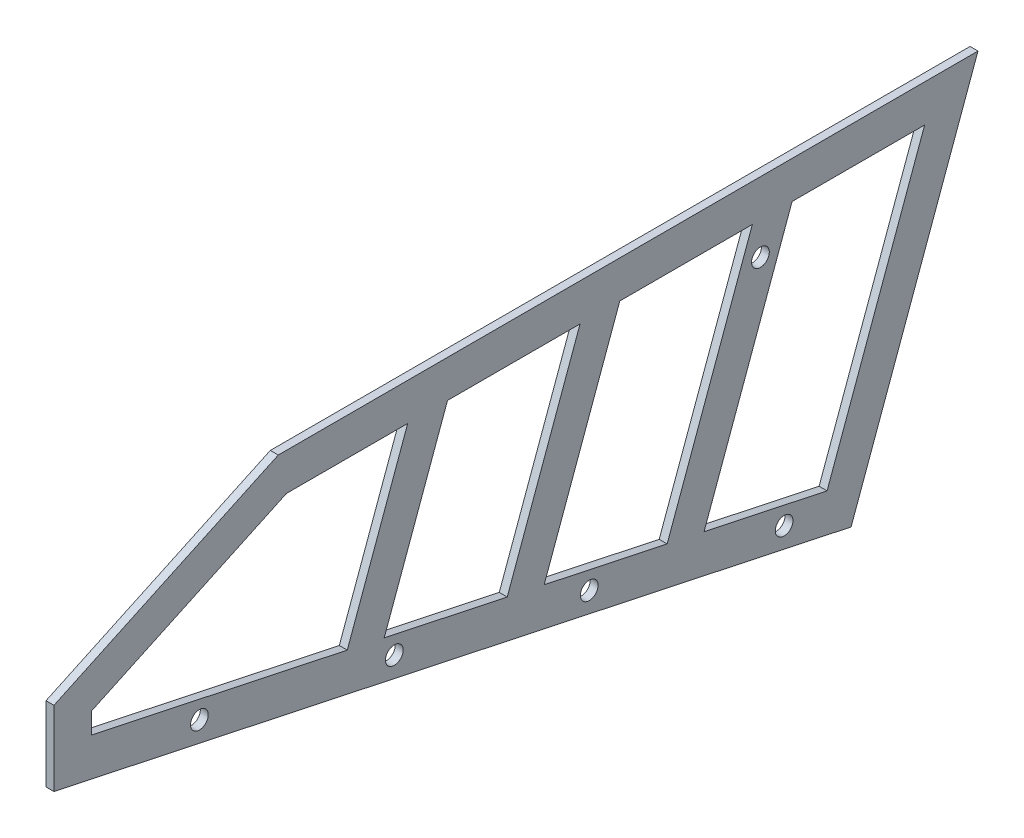
ISO-10303-21;
HEADER;
FILE_DESCRIPTION(('STEP AP214'),'2;1');
FILE_NAME('part.step','',(''),(''),'','','');
FILE_SCHEMA(('AUTOMOTIVE_DESIGN { 1 0 10303 214 1 1 1 1 }'));
ENDSEC;
DATA;
#1=APPLICATION_CONTEXT('core data for automotive mechanical design processes');
#2=APPLICATION_PROTOCOL_DEFINITION('international standard','automotive_design',2000,#1);
#3=PRODUCT_CONTEXT('',#1,'mechanical');
#4=PRODUCT('Part','Part','',(#3));
#5=PRODUCT_RELATED_PRODUCT_CATEGORY('part','',(#4));
#6=PRODUCT_DEFINITION_FORMATION('','',#4);
#7=PRODUCT_DEFINITION_CONTEXT('part definition',#1,'design');
#8=PRODUCT_DEFINITION('design','',#6,#7);
#9=PRODUCT_DEFINITION_SHAPE('','',#8);
#10=(LENGTH_UNIT() NAMED_UNIT(*) SI_UNIT(.MILLI.,.METRE.));
#11=(NAMED_UNIT(*) PLANE_ANGLE_UNIT() SI_UNIT($,.RADIAN.));
#12=(NAMED_UNIT(*) SI_UNIT($,.STERADIAN.) SOLID_ANGLE_UNIT());
#13=UNCERTAINTY_MEASURE_WITH_UNIT(LENGTH_MEASURE(1.E-05),#10,'distance_accuracy_value','');
#14=(GEOMETRIC_REPRESENTATION_CONTEXT(3) GLOBAL_UNCERTAINTY_ASSIGNED_CONTEXT((#13)) GLOBAL_UNIT_ASSIGNED_CONTEXT((#10,
#11,#12)) REPRESENTATION_CONTEXT('',''));
#15=CARTESIAN_POINT('',(0.,0.,0.));
#16=DIRECTION('',(0.,0.,1.));
#17=DIRECTION('',(1.,0.,0.));
#18=AXIS2_PLACEMENT_3D('',#15,#16,#17);
#19=CARTESIAN_POINT('',(1.651,44.45,-16.1784769131329));
#20=DIRECTION('',(0.,1.,0.));
#21=DIRECTION('',(0.,0.,1.));
#22=AXIS2_PLACEMENT_3D('',#19,#20,#21);
#23=PLANE('',#22);
#24=DIRECTION('',(0.,0.,-1.));
#25=VECTOR('',#24,1.);
#26=CARTESIAN_POINT('',(0.635,44.45,-16.1784769131329));
#27=LINE('',#26,#25);
#28=CARTESIAN_POINT('',(0.635,44.45,73.0153239793115));
#29=VERTEX_POINT('',#28);
#30=CARTESIAN_POINT('',(0.635,44.45,-16.1784769131329));
#31=VERTEX_POINT('',#30);
#32=EDGE_CURVE('E340',#29,#31,#27,.T.);
#33=ORIENTED_EDGE('',*,*,#32,.F.);
#34=DIRECTION('',(-1.,0.,0.));
#35=VECTOR('',#34,1.);
#36=CARTESIAN_POINT('',(1.651,44.45,73.0153239793115));
#37=LINE('',#36,#35);
#38=CARTESIAN_POINT('',(1.651,44.45,73.0153239793115));
#39=VERTEX_POINT('',#38);
#40=EDGE_CURVE('E11',#39,#29,#37,.T.);
#41=ORIENTED_EDGE('',*,*,#40,.F.);
#42=DIRECTION('',(0.,0.,-1.));
#43=VECTOR('',#42,1.);
#44=CARTESIAN_POINT('',(1.651,44.45,-16.1784769131329));
#45=LINE('',#44,#43);
#46=CARTESIAN_POINT('',(1.651,44.45,-16.1784769131329));
#47=VERTEX_POINT('',#46);
#48=EDGE_CURVE('E349',#39,#47,#45,.T.);
#49=ORIENTED_EDGE('',*,*,#48,.T.);
#50=DIRECTION('',(-1.,0.,0.));
#51=VECTOR('',#50,1.);
#52=CARTESIAN_POINT('',(1.651,44.45,-16.1784769131329));
#53=LINE('',#52,#51);
#54=EDGE_CURVE('E34',#47,#31,#53,.T.);
#55=ORIENTED_EDGE('',*,*,#54,.T.);
#56=EDGE_LOOP('',(#33,#41,#49,#55));
#57=FACE_BOUND('',#56,.T.);
#58=ADVANCED_FACE('F31',(#57),#23,.T.);
#59=CARTESIAN_POINT('',(1.651,44.45,73.0153239793115));
#60=DIRECTION('',(0.,0.906307787036651,0.422618261740697));
#61=DIRECTION('',(0.,-0.422618261740697,0.906307787036651));
#62=AXIS2_PLACEMENT_3D('',#59,#60,#61);
#63=PLANE('',#62);
#64=DIRECTION('',(0.,0.422618261740697,-0.906307787036651));
#65=VECTOR('',#64,1.);
#66=CARTESIAN_POINT('',(0.635,44.45,73.0153239793115));
#67=LINE('',#66,#65);
#68=CARTESIAN_POINT('',(0.635,31.1207466656735,101.6));
#69=VERTEX_POINT('',#68);
#70=EDGE_CURVE('E353',#69,#29,#67,.T.);
#71=ORIENTED_EDGE('',*,*,#70,.F.);
#72=DIRECTION('',(-1.,0.,0.));
#73=VECTOR('',#72,1.);
#74=CARTESIAN_POINT('',(1.651,31.1207466656735,101.6));
#75=LINE('',#74,#73);
#76=CARTESIAN_POINT('',(1.651,31.1207466656735,101.6));
#77=VERTEX_POINT('',#76);
#78=EDGE_CURVE('E39',#77,#69,#75,.T.);
#79=ORIENTED_EDGE('',*,*,#78,.F.);
#80=DIRECTION('',(0.,0.422618261740697,-0.906307787036651));
#81=VECTOR('',#80,1.);
#82=CARTESIAN_POINT('',(1.651,44.45,73.0153239793115));
#83=LINE('',#82,#81);
#84=EDGE_CURVE('E362',#77,#39,#83,.T.);
#85=ORIENTED_EDGE('',*,*,#84,.T.);
#86=ORIENTED_EDGE('',*,*,#40,.T.);
#87=EDGE_LOOP('',(#71,#79,#85,#86));
#88=FACE_BOUND('',#87,.T.);
#89=ADVANCED_FACE('F394',(#88),#63,.T.);
#90=CARTESIAN_POINT('',(1.651,21.5957466656735,101.6));
#91=DIRECTION('',(0.,0.,1.));
#92=DIRECTION('',(0.,-1.,0.));
#93=AXIS2_PLACEMENT_3D('',#90,#91,#92);
#94=PLANE('',#93);
#95=DIRECTION('',(0.,1.,0.));
#96=VECTOR('',#95,1.);
#97=CARTESIAN_POINT('',(0.635,21.5957466656735,101.6));
#98=LINE('',#97,#96);
#99=CARTESIAN_POINT('',(0.635,21.5957466656735,101.6));
#100=VERTEX_POINT('',#99);
#101=EDGE_CURVE('E373',#100,#69,#98,.T.);
#102=ORIENTED_EDGE('',*,*,#101,.F.);
#103=DIRECTION('',(-1.,0.,0.));
#104=VECTOR('',#103,1.);
#105=CARTESIAN_POINT('',(1.651,21.5957466656735,101.6));
#106=LINE('',#105,#104);
#107=CARTESIAN_POINT('',(1.651,21.5957466656735,101.6));
#108=VERTEX_POINT('',#107);
#109=EDGE_CURVE('E379',#108,#100,#106,.T.);
#110=ORIENTED_EDGE('',*,*,#109,.F.);
#111=DIRECTION('',(0.,1.,0.));
#112=VECTOR('',#111,1.);
#113=CARTESIAN_POINT('',(1.651,21.5957466656735,101.6));
#114=LINE('',#113,#112);
#115=EDGE_CURVE('E359',#108,#77,#114,.T.);
#116=ORIENTED_EDGE('',*,*,#115,.T.);
#117=ORIENTED_EDGE('',*,*,#78,.T.);
#118=EDGE_LOOP('',(#102,#110,#116,#117));
#119=FACE_BOUND('',#118,.T.);
#120=ADVANCED_FACE('F402',(#119),#94,.T.);
#121=CARTESIAN_POINT('',(1.651,0.,0.));
#122=DIRECTION('',(0.,-0.978147600733807,0.207911690817752));
#123=DIRECTION('',(0.,-0.207911690817753,-0.978147600733807));
#124=AXIS2_PLACEMENT_3D('',#121,#122,#123);
#125=PLANE('',#124);
#126=DIRECTION('',(0.,0.207911690817753,0.978147600733807));
#127=VECTOR('',#126,1.);
#128=CARTESIAN_POINT('',(0.635,0.,0.));
#129=LINE('',#128,#127);
#130=CARTESIAN_POINT('',(0.635,0.,0.));
#131=VERTEX_POINT('',#130);
#132=EDGE_CURVE('E370',#131,#100,#129,.T.);
#133=ORIENTED_EDGE('',*,*,#132,.F.);
#134=DIRECTION('',(-1.,0.,0.));
#135=VECTOR('',#134,1.);
#136=CARTESIAN_POINT('',(1.651,0.,0.));
#137=LINE('',#136,#135);
#138=CARTESIAN_POINT('',(1.651,0.,0.));
#139=VERTEX_POINT('',#138);
#140=EDGE_CURVE('E380',#139,#131,#137,.T.);
#141=ORIENTED_EDGE('',*,*,#140,.F.);
#142=DIRECTION('',(0.,0.207911690817753,0.978147600733807));
#143=VECTOR('',#142,1.);
#144=CARTESIAN_POINT('',(1.651,0.,0.));
#145=LINE('',#144,#143);
#146=EDGE_CURVE('E356',#139,#108,#145,.T.);
#147=ORIENTED_EDGE('',*,*,#146,.T.);
#148=ORIENTED_EDGE('',*,*,#109,.T.);
#149=EDGE_LOOP('',(#133,#141,#147,#148));
#150=FACE_BOUND('',#149,.T.);
#151=ADVANCED_FACE('F400',(#150),#125,.T.);
#152=CARTESIAN_POINT('',(1.651,44.45,-16.1784769131329));
#153=DIRECTION('',(0.,-0.342020143325673,-0.939692620785907));
#154=DIRECTION('',(0.,0.939692620785907,-0.342020143325673));
#155=AXIS2_PLACEMENT_3D('',#152,#153,#154);
#156=PLANE('',#155);
#157=DIRECTION('',(0.,-0.939692620785907,0.342020143325673));
#158=VECTOR('',#157,1.);
#159=CARTESIAN_POINT('',(0.635,44.45,-16.1784769131329));
#160=LINE('',#159,#158);
#161=EDGE_CURVE('E367',#31,#131,#160,.T.);
#162=ORIENTED_EDGE('',*,*,#161,.F.);
#163=ORIENTED_EDGE('',*,*,#54,.F.);
#164=DIRECTION('',(0.,-0.939692620785907,0.342020143325673));
#165=VECTOR('',#164,1.);
#166=CARTESIAN_POINT('',(1.651,44.45,-16.1784769131329));
#167=LINE('',#166,#165);
#168=EDGE_CURVE('E352',#47,#139,#167,.T.);
#169=ORIENTED_EDGE('',*,*,#168,.T.);
#170=ORIENTED_EDGE('',*,*,#140,.T.);
#171=EDGE_LOOP('',(#162,#163,#169,#170));
#172=FACE_BOUND('',#171,.T.);
#173=ADVANCED_FACE('F388',(#172),#156,.T.);
#174=CARTESIAN_POINT('',(1.651,44.45,101.6));
#175=DIRECTION('',(-1.,0.,0.));
#176=DIRECTION('',(0.,0.,1.));
#177=AXIS2_PLACEMENT_3D('',#174,#175,#176);
#178=PLANE('',#177);
#179=CARTESIAN_POINT('',(1.651,35.56,11.5532605696736));
#180=DIRECTION('',(1.,0.,0.));
#181=DIRECTION('',(0.,0.,-1.));
#182=AXIS2_PLACEMENT_3D('',#179,#180,#181);
#183=CIRCLE('',#182,1.1303);
#184=CARTESIAN_POINT('',(1.651,35.56,10.4229605696736));
#185=VERTEX_POINT('',#184);
#186=EDGE_CURVE('E204',#185,#185,#183,.T.);
#187=ORIENTED_EDGE('',*,*,#186,.F.);
#188=EDGE_LOOP('',(#187));
#189=FACE_BOUND('',#188,.T.);
#190=DIRECTION('',(0.,0.939692620785907,-0.342020143325672));
#191=VECTOR('',#190,1.);
#192=CARTESIAN_POINT('',(1.651,39.6875,51.4408376659749));
#193=LINE('',#192,#191);
#194=CARTESIAN_POINT('',(1.651,17.5181036446952,59.5098380509556));
#195=VERTEX_POINT('',#194);
#196=CARTESIAN_POINT('',(1.651,39.6875,51.4408376659749));
#197=VERTEX_POINT('',#196);
#198=EDGE_CURVE('E188',#195,#197,#193,.T.);
#199=ORIENTED_EDGE('',*,*,#198,.T.);
#200=DIRECTION('',(0.,0.,-1.));
#201=VECTOR('',#200,1.);
#202=CARTESIAN_POINT('',(1.651,39.6875,51.4408376659749));
#203=LINE('',#202,#201);
#204=CARTESIAN_POINT('',(1.651,39.6875,34.5470155279198));
#205=VERTEX_POINT('',#204);
#206=EDGE_CURVE('E182',#197,#205,#203,.T.);
#207=ORIENTED_EDGE('',*,*,#206,.T.);
#208=DIRECTION('',(0.,-0.939692620785907,0.342020143325673));
#209=VECTOR('',#208,1.);
#210=CARTESIAN_POINT('',(1.651,39.6875,34.5470155279198));
#211=LINE('',#210,#209);
#212=CARTESIAN_POINT('',(1.651,14.1850686858621,43.8291414276844));
#213=VERTEX_POINT('',#212);
#214=EDGE_CURVE('E191',#205,#213,#211,.T.);
#215=ORIENTED_EDGE('',*,*,#214,.T.);
#216=DIRECTION('',(0.,0.207911690817752,0.978147600733807));
#217=VECTOR('',#216,1.);
#218=CARTESIAN_POINT('',(1.651,14.1850686858621,43.8291414276844));
#219=LINE('',#218,#217);
#220=EDGE_CURVE('E47',#213,#195,#219,.T.);
#221=ORIENTED_EDGE('',*,*,#220,.T.);
#222=EDGE_LOOP('',(#199,#207,#215,#221));
#223=FACE_BOUND('',#222,.T.);
#224=DIRECTION('',(0.,0.,-1.));
#225=VECTOR('',#224,1.);
#226=CARTESIAN_POINT('',(1.651,39.6875,29.4788688865032));
#227=LINE('',#226,#225);
#228=CARTESIAN_POINT('',(1.651,39.6875,29.4788688865032));
#229=VERTEX_POINT('',#228);
#230=CARTESIAN_POINT('',(1.651,39.6875,12.5850467484481));
#231=VERTEX_POINT('',#230);
#232=EDGE_CURVE('E231',#229,#231,#227,.T.);
#233=ORIENTED_EDGE('',*,*,#232,.T.);
#234=DIRECTION('',(0.,-0.939692620785907,0.342020143325673));
#235=VECTOR('',#234,1.);
#236=CARTESIAN_POINT('',(1.651,39.6875,12.5850467484481));
#237=LINE('',#236,#235);
#238=CARTESIAN_POINT('',(1.651,9.85212323937903,23.4442358174319));
#239=VERTEX_POINT('',#238);
#240=EDGE_CURVE('E221',#231,#239,#237,.T.);
#241=ORIENTED_EDGE('',*,*,#240,.T.);
#242=DIRECTION('',(0.,0.207911690817753,0.978147600733807));
#243=VECTOR('',#242,1.);
#244=CARTESIAN_POINT('',(1.651,9.85212323937903,23.4442358174319));
#245=LINE('',#244,#243);
#246=CARTESIAN_POINT('',(1.651,13.1851581982122,39.1249324407031));
#247=VERTEX_POINT('',#246);
#248=EDGE_CURVE('E224',#239,#247,#245,.T.);
#249=ORIENTED_EDGE('',*,*,#248,.T.);
#250=DIRECTION('',(0.,0.939692620785907,-0.342020143325673));
#251=VECTOR('',#250,1.);
#252=CARTESIAN_POINT('',(1.651,39.6875,29.4788688865032));
#253=LINE('',#252,#251);
#254=EDGE_CURVE('E228',#247,#229,#253,.T.);
#255=ORIENTED_EDGE('',*,*,#254,.T.);
#256=EDGE_LOOP('',(#233,#241,#249,#255));
#257=FACE_BOUND('',#256,.T.);
#258=CARTESIAN_POINT('',(1.651,20.2529677117438,83.0659964673177));
#259=DIRECTION('',(-1.,0.,0.));
#260=DIRECTION('',(0.,0.,1.));
#261=AXIS2_PLACEMENT_3D('',#258,#259,#260);
#262=CIRCLE('',#261,1.1303);
#263=CARTESIAN_POINT('',(1.651,20.2529677117438,84.1962964673177));
#264=VERTEX_POINT('',#263);
#265=EDGE_CURVE('E253',#264,#264,#262,.T.);
#266=ORIENTED_EDGE('',*,*,#265,.T.);
#267=EDGE_LOOP('',(#266));
#268=FACE_BOUND('',#267,.T.);
#269=CARTESIAN_POINT('',(1.651,14.9720107649729,58.221047408679));
#270=DIRECTION('',(-1.,0.,0.));
#271=DIRECTION('',(0.,0.,1.));
#272=AXIS2_PLACEMENT_3D('',#269,#270,#271);
#273=CIRCLE('',#272,1.1303);
#274=CARTESIAN_POINT('',(1.651,14.9720107649729,59.351347408679));
#275=VERTEX_POINT('',#274);
#276=EDGE_CURVE('E259',#275,#275,#273,.T.);
#277=ORIENTED_EDGE('',*,*,#276,.T.);
#278=EDGE_LOOP('',(#277));
#279=FACE_BOUND('',#278,.T.);
#280=CARTESIAN_POINT('',(1.651,9.691053818202,33.3760983500403));
#281=DIRECTION('',(-1.,0.,0.));
#282=DIRECTION('',(0.,0.,1.));
#283=AXIS2_PLACEMENT_3D('',#280,#281,#282);
#284=CIRCLE('',#283,1.1303);
#285=CARTESIAN_POINT('',(1.651,9.691053818202,34.5063983500403));
#286=VERTEX_POINT('',#285);
#287=EDGE_CURVE('E265',#286,#286,#284,.T.);
#288=ORIENTED_EDGE('',*,*,#287,.T.);
#289=EDGE_LOOP('',(#288));
#290=FACE_BOUND('',#289,.T.);
#291=CARTESIAN_POINT('',(1.651,4.41009687143108,8.53114929140164));
#292=DIRECTION('',(-1.,0.,0.));
#293=DIRECTION('',(0.,0.,1.));
#294=AXIS2_PLACEMENT_3D('',#291,#292,#293);
#295=CIRCLE('',#294,1.1303);
#296=CARTESIAN_POINT('',(1.651,4.41009687143108,9.66144929140164));
#297=VERTEX_POINT('',#296);
#298=EDGE_CURVE('E271',#297,#297,#295,.T.);
#299=ORIENTED_EDGE('',*,*,#298,.T.);
#300=EDGE_LOOP('',(#299));
#301=FACE_BOUND('',#300,.T.);
#302=DIRECTION('',(0.,0.,-1.));
#303=VECTOR('',#302,1.);
#304=CARTESIAN_POINT('',(1.651,39.6875,7.51690010703158));
#305=LINE('',#304,#303);
#306=CARTESIAN_POINT('',(1.651,39.6875,7.51690010703158));
#307=VERTEX_POINT('',#306);
#308=CARTESIAN_POINT('',(1.651,39.6875,-9.37692203102355));
#309=VERTEX_POINT('',#308);
#310=EDGE_CURVE('E287',#307,#309,#305,.T.);
#311=ORIENTED_EDGE('',*,*,#310,.T.);
#312=DIRECTION('',(0.,-0.939692620785907,0.342020143325673));
#313=VECTOR('',#312,1.);
#314=CARTESIAN_POINT('',(1.651,39.6875,-9.37692203102355));
#315=LINE('',#314,#313);
#316=CARTESIAN_POINT('',(1.651,5.51917779289595,3.05933020717935));
#317=VERTEX_POINT('',#316);
#318=EDGE_CURVE('E277',#309,#317,#315,.T.);
#319=ORIENTED_EDGE('',*,*,#318,.T.);
#320=DIRECTION('',(0.,0.207911690817753,0.978147600733807));
#321=VECTOR('',#320,1.);
#322=CARTESIAN_POINT('',(1.651,5.51917779289595,3.05933020717935));
#323=LINE('',#322,#321);
#324=CARTESIAN_POINT('',(1.651,8.85221275172909,18.7400268304505));
#325=VERTEX_POINT('',#324);
#326=EDGE_CURVE('E280',#317,#325,#323,.T.);
#327=ORIENTED_EDGE('',*,*,#326,.T.);
#328=DIRECTION('',(0.,0.939692620785907,-0.342020143325673));
#329=VECTOR('',#328,1.);
#330=CARTESIAN_POINT('',(1.651,39.6875,7.51690010703158));
#331=LINE('',#330,#329);
#332=EDGE_CURVE('E284',#325,#307,#331,.T.);
#333=ORIENTED_EDGE('',*,*,#332,.T.);
#334=EDGE_LOOP('',(#311,#319,#327,#333));
#335=FACE_BOUND('',#334,.T.);
#336=DIRECTION('',(0.,1.,0.));
#337=VECTOR('',#336,1.);
#338=CARTESIAN_POINT('',(1.651,25.4523431237648,96.8375));
#339=LINE('',#338,#337);
#340=CARTESIAN_POINT('',(1.651,25.4523431237648,96.8375));
#341=VERTEX_POINT('',#340);
#342=CARTESIAN_POINT('',(1.651,28.0866995485778,96.8375));
#343=VERTEX_POINT('',#342);
#344=EDGE_CURVE('E322',#341,#343,#339,.T.);
#345=ORIENTED_EDGE('',*,*,#344,.T.);
#346=DIRECTION('',(0.,0.422618261740697,-0.906307787036651));
#347=VECTOR('',#346,1.);
#348=CARTESIAN_POINT('',(1.651,28.0866995485778,96.8375));
#349=LINE('',#348,#347);
#350=CARTESIAN_POINT('',(1.651,39.6875,71.9595031484745));
#351=VERTEX_POINT('',#350);
#352=EDGE_CURVE('E309',#343,#351,#349,.T.);
#353=ORIENTED_EDGE('',*,*,#352,.T.);
#354=DIRECTION('',(0.,0.,-1.));
#355=VECTOR('',#354,1.);
#356=CARTESIAN_POINT('',(1.651,39.6875,71.9595031484745));
#357=LINE('',#356,#355);
#358=CARTESIAN_POINT('',(1.651,39.6875,56.5089843073915));
#359=VERTEX_POINT('',#358);
#360=EDGE_CURVE('E312',#351,#359,#357,.T.);
#361=ORIENTED_EDGE('',*,*,#360,.T.);
#362=DIRECTION('',(0.,-0.939692620785907,0.342020143325673));
#363=VECTOR('',#362,1.);
#364=CARTESIAN_POINT('',(1.651,39.6875,56.5089843073915));
#365=LINE('',#364,#363);
#366=CARTESIAN_POINT('',(1.651,18.5180141323452,64.214047037937));
#367=VERTEX_POINT('',#366);
#368=EDGE_CURVE('E316',#359,#367,#365,.T.);
#369=ORIENTED_EDGE('',*,*,#368,.T.);
#370=DIRECTION('',(0.,0.207911690817753,0.978147600733807));
#371=VECTOR('',#370,1.);
#372=CARTESIAN_POINT('',(1.651,18.5180141323452,64.214047037937));
#373=LINE('',#372,#371);
#374=EDGE_CURVE('E319',#367,#341,#373,.T.);
#375=ORIENTED_EDGE('',*,*,#374,.T.);
#376=EDGE_LOOP('',(#345,#353,#361,#369,#375));
#377=FACE_BOUND('',#376,.T.);
#378=ORIENTED_EDGE('',*,*,#48,.F.);
#379=ORIENTED_EDGE('',*,*,#84,.F.);
#380=ORIENTED_EDGE('',*,*,#115,.F.);
#381=ORIENTED_EDGE('',*,*,#146,.F.);
#382=ORIENTED_EDGE('',*,*,#168,.F.);
#383=EDGE_LOOP('',(#378,#379,#380,#381,#382));
#384=FACE_BOUND('',#383,.T.);
#385=ADVANCED_FACE('F195',(#189,#223,#257,#268,#279,#290,#301,#335,#377,#384),#178,.F.);
#386=CARTESIAN_POINT('',(0.635,44.45,101.6));
#387=DIRECTION('',(-1.,0.,0.));
#388=DIRECTION('',(0.,0.,1.));
#389=AXIS2_PLACEMENT_3D('',#386,#387,#388);
#390=PLANE('',#389);
#391=CARTESIAN_POINT('',(0.635,35.56,11.5532605696736));
#392=DIRECTION('',(1.,0.,0.));
#393=DIRECTION('',(0.,0.,-1.));
#394=AXIS2_PLACEMENT_3D('',#391,#392,#393);
#395=CIRCLE('',#394,1.1303);
#396=CARTESIAN_POINT('',(0.635,35.56,10.4229605696736));
#397=VERTEX_POINT('',#396);
#398=EDGE_CURVE('E211',#397,#397,#395,.T.);
#399=ORIENTED_EDGE('',*,*,#398,.T.);
#400=EDGE_LOOP('',(#399));
#401=FACE_BOUND('',#400,.T.);
#402=DIRECTION('',(0.,0.,-1.));
#403=VECTOR('',#402,1.);
#404=CARTESIAN_POINT('',(0.635,39.6875,51.4408376659749));
#405=LINE('',#404,#403);
#406=CARTESIAN_POINT('',(0.635,39.6875,51.4408376659749));
#407=VERTEX_POINT('',#406);
#408=CARTESIAN_POINT('',(0.635,39.6875,34.5470155279198));
#409=VERTEX_POINT('',#408);
#410=EDGE_CURVE('E55',#407,#409,#405,.T.);
#411=ORIENTED_EDGE('',*,*,#410,.F.);
#412=DIRECTION('',(0.,0.939692620785907,-0.342020143325672));
#413=VECTOR('',#412,1.);
#414=CARTESIAN_POINT('',(0.635,39.6875,51.4408376659749));
#415=LINE('',#414,#413);
#416=CARTESIAN_POINT('',(0.635,17.5181036446952,59.5098380509556));
#417=VERTEX_POINT('',#416);
#418=EDGE_CURVE('E198',#417,#407,#415,.T.);
#419=ORIENTED_EDGE('',*,*,#418,.F.);
#420=DIRECTION('',(0.,0.207911690817752,0.978147600733807));
#421=VECTOR('',#420,1.);
#422=CARTESIAN_POINT('',(0.635,14.1850686858621,43.8291414276844));
#423=LINE('',#422,#421);
#424=CARTESIAN_POINT('',(0.635,14.1850686858621,43.8291414276844));
#425=VERTEX_POINT('',#424);
#426=EDGE_CURVE('E201',#425,#417,#423,.T.);
#427=ORIENTED_EDGE('',*,*,#426,.F.);
#428=DIRECTION('',(0.,-0.939692620785907,0.342020143325673));
#429=VECTOR('',#428,1.);
#430=CARTESIAN_POINT('',(0.635,39.6875,34.5470155279198));
#431=LINE('',#430,#429);
#432=EDGE_CURVE('E210',#409,#425,#431,.T.);
#433=ORIENTED_EDGE('',*,*,#432,.F.);
#434=EDGE_LOOP('',(#411,#419,#427,#433));
#435=FACE_BOUND('',#434,.T.);
#436=DIRECTION('',(0.,-0.939692620785907,0.342020143325673));
#437=VECTOR('',#436,1.);
#438=CARTESIAN_POINT('',(0.635,39.6875,12.5850467484481));
#439=LINE('',#438,#437);
#440=CARTESIAN_POINT('',(0.635,39.6875,12.5850467484481));
#441=VERTEX_POINT('',#440);
#442=CARTESIAN_POINT('',(0.635,9.85212323937903,23.4442358174319));
#443=VERTEX_POINT('',#442);
#444=EDGE_CURVE('E217',#441,#443,#439,.T.);
#445=ORIENTED_EDGE('',*,*,#444,.F.);
#446=DIRECTION('',(0.,0.,-1.));
#447=VECTOR('',#446,1.);
#448=CARTESIAN_POINT('',(0.635,39.6875,29.4788688865032));
#449=LINE('',#448,#447);
#450=CARTESIAN_POINT('',(0.635,39.6875,29.4788688865032));
#451=VERTEX_POINT('',#450);
#452=EDGE_CURVE('E225',#451,#441,#449,.T.);
#453=ORIENTED_EDGE('',*,*,#452,.F.);
#454=DIRECTION('',(0.,0.939692620785907,-0.342020143325673));
#455=VECTOR('',#454,1.);
#456=CARTESIAN_POINT('',(0.635,39.6875,29.4788688865032));
#457=LINE('',#456,#455);
#458=CARTESIAN_POINT('',(0.635,13.1851581982122,39.1249324407031));
#459=VERTEX_POINT('',#458);
#460=EDGE_CURVE('E239',#459,#451,#457,.T.);
#461=ORIENTED_EDGE('',*,*,#460,.F.);
#462=DIRECTION('',(0.,0.207911690817753,0.978147600733807));
#463=VECTOR('',#462,1.);
#464=CARTESIAN_POINT('',(0.635,9.85212323937903,23.4442358174319));
#465=LINE('',#464,#463);
#466=EDGE_CURVE('E236',#443,#459,#465,.T.);
#467=ORIENTED_EDGE('',*,*,#466,.F.);
#468=EDGE_LOOP('',(#445,#453,#461,#467));
#469=FACE_BOUND('',#468,.T.);
#470=CARTESIAN_POINT('',(0.635,20.2529677117438,83.0659964673177));
#471=DIRECTION('',(-1.,0.,0.));
#472=DIRECTION('',(0.,0.,1.));
#473=AXIS2_PLACEMENT_3D('',#470,#471,#472);
#474=CIRCLE('',#473,1.1303);
#475=CARTESIAN_POINT('',(0.635,20.2529677117438,84.1962964673177));
#476=VERTEX_POINT('',#475);
#477=EDGE_CURVE('E246',#476,#476,#474,.T.);
#478=ORIENTED_EDGE('',*,*,#477,.F.);
#479=EDGE_LOOP('',(#478));
#480=FACE_BOUND('',#479,.T.);
#481=CARTESIAN_POINT('',(0.635,14.9720107649729,58.221047408679));
#482=DIRECTION('',(-1.,0.,0.));
#483=DIRECTION('',(0.,0.,1.));
#484=AXIS2_PLACEMENT_3D('',#481,#482,#483);
#485=CIRCLE('',#484,1.1303);
#486=CARTESIAN_POINT('',(0.635,14.9720107649729,59.351347408679));
#487=VERTEX_POINT('',#486);
#488=EDGE_CURVE('E256',#487,#487,#485,.T.);
#489=ORIENTED_EDGE('',*,*,#488,.F.);
#490=EDGE_LOOP('',(#489));
#491=FACE_BOUND('',#490,.T.);
#492=CARTESIAN_POINT('',(0.635,9.691053818202,33.3760983500403));
#493=DIRECTION('',(-1.,0.,0.));
#494=DIRECTION('',(0.,0.,1.));
#495=AXIS2_PLACEMENT_3D('',#492,#493,#494);
#496=CIRCLE('',#495,1.1303);
#497=CARTESIAN_POINT('',(0.635,9.691053818202,34.5063983500403));
#498=VERTEX_POINT('',#497);
#499=EDGE_CURVE('E262',#498,#498,#496,.T.);
#500=ORIENTED_EDGE('',*,*,#499,.F.);
#501=EDGE_LOOP('',(#500));
#502=FACE_BOUND('',#501,.T.);
#503=CARTESIAN_POINT('',(0.635,4.41009687143108,8.53114929140164));
#504=DIRECTION('',(-1.,0.,0.));
#505=DIRECTION('',(0.,0.,1.));
#506=AXIS2_PLACEMENT_3D('',#503,#504,#505);
#507=CIRCLE('',#506,1.1303);
#508=CARTESIAN_POINT('',(0.635,4.41009687143108,9.66144929140164));
#509=VERTEX_POINT('',#508);
#510=EDGE_CURVE('E268',#509,#509,#507,.T.);
#511=ORIENTED_EDGE('',*,*,#510,.F.);
#512=EDGE_LOOP('',(#511));
#513=FACE_BOUND('',#512,.T.);
#514=DIRECTION('',(0.,-0.939692620785907,0.342020143325673));
#515=VECTOR('',#514,1.);
#516=CARTESIAN_POINT('',(0.635,39.6875,-9.37692203102355));
#517=LINE('',#516,#515);
#518=CARTESIAN_POINT('',(0.635,39.6875,-9.37692203102355));
#519=VERTEX_POINT('',#518);
#520=CARTESIAN_POINT('',(0.635,5.51917779289595,3.05933020717934));
#521=VERTEX_POINT('',#520);
#522=EDGE_CURVE('E274',#519,#521,#517,.T.);
#523=ORIENTED_EDGE('',*,*,#522,.F.);
#524=DIRECTION('',(0.,0.,-1.));
#525=VECTOR('',#524,1.);
#526=CARTESIAN_POINT('',(0.635,39.6875,7.51690010703158));
#527=LINE('',#526,#525);
#528=CARTESIAN_POINT('',(0.635,39.6875,7.51690010703158));
#529=VERTEX_POINT('',#528);
#530=EDGE_CURVE('E281',#529,#519,#527,.T.);
#531=ORIENTED_EDGE('',*,*,#530,.F.);
#532=DIRECTION('',(0.,0.939692620785907,-0.342020143325673));
#533=VECTOR('',#532,1.);
#534=CARTESIAN_POINT('',(0.635,39.6875,7.51690010703158));
#535=LINE('',#534,#533);
#536=CARTESIAN_POINT('',(0.635,8.85221275172909,18.7400268304505));
#537=VERTEX_POINT('',#536);
#538=EDGE_CURVE('E295',#537,#529,#535,.T.);
#539=ORIENTED_EDGE('',*,*,#538,.F.);
#540=DIRECTION('',(0.,0.207911690817753,0.978147600733807));
#541=VECTOR('',#540,1.);
#542=CARTESIAN_POINT('',(0.635,5.51917779289595,3.05933020717935));
#543=LINE('',#542,#541);
#544=EDGE_CURVE('E292',#521,#537,#543,.T.);
#545=ORIENTED_EDGE('',*,*,#544,.F.);
#546=EDGE_LOOP('',(#523,#531,#539,#545));
#547=FACE_BOUND('',#546,.T.);
#548=DIRECTION('',(0.,0.422618261740697,-0.906307787036651));
#549=VECTOR('',#548,1.);
#550=CARTESIAN_POINT('',(0.635,28.0866995485778,96.8375));
#551=LINE('',#550,#549);
#552=CARTESIAN_POINT('',(0.635,28.0866995485778,96.8375));
#553=VERTEX_POINT('',#552);
#554=CARTESIAN_POINT('',(0.635,39.6875,71.9595031484745));
#555=VERTEX_POINT('',#554);
#556=EDGE_CURVE('E302',#553,#555,#551,.T.);
#557=ORIENTED_EDGE('',*,*,#556,.F.);
#558=DIRECTION('',(0.,1.,0.));
#559=VECTOR('',#558,1.);
#560=CARTESIAN_POINT('',(0.635,25.4523431237648,96.8375));
#561=LINE('',#560,#559);
#562=CARTESIAN_POINT('',(0.635,25.4523431237648,96.8375));
#563=VERTEX_POINT('',#562);
#564=EDGE_CURVE('E313',#563,#553,#561,.T.);
#565=ORIENTED_EDGE('',*,*,#564,.F.);
#566=DIRECTION('',(0.,0.207911690817753,0.978147600733807));
#567=VECTOR('',#566,1.);
#568=CARTESIAN_POINT('',(0.635,18.5180141323452,64.214047037937));
#569=LINE('',#568,#567);
#570=CARTESIAN_POINT('',(0.635,18.5180141323452,64.214047037937));
#571=VERTEX_POINT('',#570);
#572=EDGE_CURVE('E333',#571,#563,#569,.T.);
#573=ORIENTED_EDGE('',*,*,#572,.F.);
#574=DIRECTION('',(0.,-0.939692620785907,0.342020143325673));
#575=VECTOR('',#574,1.);
#576=CARTESIAN_POINT('',(0.635,39.6875,56.5089843073915));
#577=LINE('',#576,#575);
#578=CARTESIAN_POINT('',(0.635,39.6875,56.5089843073915));
#579=VERTEX_POINT('',#578);
#580=EDGE_CURVE('E330',#579,#571,#577,.T.);
#581=ORIENTED_EDGE('',*,*,#580,.F.);
#582=DIRECTION('',(0.,0.,-1.));
#583=VECTOR('',#582,1.);
#584=CARTESIAN_POINT('',(0.635,39.6875,71.9595031484745));
#585=LINE('',#584,#583);
#586=EDGE_CURVE('E327',#555,#579,#585,.T.);
#587=ORIENTED_EDGE('',*,*,#586,.F.);
#588=EDGE_LOOP('',(#557,#565,#573,#581,#587));
#589=FACE_BOUND('',#588,.T.);
#590=ORIENTED_EDGE('',*,*,#32,.T.);
#591=ORIENTED_EDGE('',*,*,#161,.T.);
#592=ORIENTED_EDGE('',*,*,#132,.T.);
#593=ORIENTED_EDGE('',*,*,#101,.T.);
#594=ORIENTED_EDGE('',*,*,#70,.T.);
#595=EDGE_LOOP('',(#590,#591,#592,#593,#594));
#596=FACE_BOUND('',#595,.T.);
#597=ADVANCED_FACE('F390',(#401,#435,#469,#480,#491,#502,#513,#547,#589,#596),#390,.T.);
#598=CARTESIAN_POINT('',(1.651,28.0866995485778,96.8375));
#599=DIRECTION('',(0.,0.906307787036651,0.422618261740697));
#600=DIRECTION('',(0.,-0.422618261740697,0.906307787036651));
#601=AXIS2_PLACEMENT_3D('',#598,#599,#600);
#602=PLANE('',#601);
#603=ORIENTED_EDGE('',*,*,#556,.T.);
#604=DIRECTION('',(-1.,0.,0.));
#605=VECTOR('',#604,1.);
#606=CARTESIAN_POINT('',(1.651,39.6875,71.9595031484745));
#607=LINE('',#606,#605);
#608=EDGE_CURVE('E325',#351,#555,#607,.T.);
#609=ORIENTED_EDGE('',*,*,#608,.F.);
#610=ORIENTED_EDGE('',*,*,#352,.F.);
#611=DIRECTION('',(-1.,0.,0.));
#612=VECTOR('',#611,1.);
#613=CARTESIAN_POINT('',(1.651,28.0866995485778,96.8375));
#614=LINE('',#613,#612);
#615=EDGE_CURVE('E338',#343,#553,#614,.T.);
#616=ORIENTED_EDGE('',*,*,#615,.T.);
#617=EDGE_LOOP('',(#603,#609,#610,#616));
#618=FACE_BOUND('',#617,.T.);
#619=ADVANCED_FACE('F442',(#618),#602,.F.);
#620=CARTESIAN_POINT('',(1.651,25.4523431237648,96.8375));
#621=DIRECTION('',(0.,0.,1.));
#622=DIRECTION('',(0.,-1.,0.));
#623=AXIS2_PLACEMENT_3D('',#620,#621,#622);
#624=PLANE('',#623);
#625=ORIENTED_EDGE('',*,*,#564,.T.);
#626=ORIENTED_EDGE('',*,*,#615,.F.);
#627=ORIENTED_EDGE('',*,*,#344,.F.);
#628=DIRECTION('',(-1.,0.,0.));
#629=VECTOR('',#628,1.);
#630=CARTESIAN_POINT('',(1.651,25.4523431237648,96.8375));
#631=LINE('',#630,#629);
#632=EDGE_CURVE('E341',#341,#563,#631,.T.);
#633=ORIENTED_EDGE('',*,*,#632,.T.);
#634=EDGE_LOOP('',(#625,#626,#627,#633));
#635=FACE_BOUND('',#634,.T.);
#636=ADVANCED_FACE('F447',(#635),#624,.F.);
#637=CARTESIAN_POINT('',(1.651,18.5180141323452,64.214047037937));
#638=DIRECTION('',(0.,-0.978147600733807,0.207911690817753));
#639=DIRECTION('',(0.,-0.207911690817753,-0.978147600733807));
#640=AXIS2_PLACEMENT_3D('',#637,#638,#639);
#641=PLANE('',#640);
#642=ORIENTED_EDGE('',*,*,#572,.T.);
#643=ORIENTED_EDGE('',*,*,#632,.F.);
#644=ORIENTED_EDGE('',*,*,#374,.F.);
#645=DIRECTION('',(-1.,0.,0.));
#646=VECTOR('',#645,1.);
#647=CARTESIAN_POINT('',(1.651,18.5180141323452,64.214047037937));
#648=LINE('',#647,#646);
#649=EDGE_CURVE('E343',#367,#571,#648,.T.);
#650=ORIENTED_EDGE('',*,*,#649,.T.);
#651=EDGE_LOOP('',(#642,#643,#644,#650));
#652=FACE_BOUND('',#651,.T.);
#653=ADVANCED_FACE('F459',(#652),#641,.F.);
#654=CARTESIAN_POINT('',(1.651,39.6875,56.5089843073915));
#655=DIRECTION('',(0.,-0.342020143325673,-0.939692620785907));
#656=DIRECTION('',(0.,0.939692620785907,-0.342020143325673));
#657=AXIS2_PLACEMENT_3D('',#654,#655,#656);
#658=PLANE('',#657);
#659=ORIENTED_EDGE('',*,*,#580,.T.);
#660=ORIENTED_EDGE('',*,*,#649,.F.);
#661=ORIENTED_EDGE('',*,*,#368,.F.);
#662=DIRECTION('',(-1.,0.,0.));
#663=VECTOR('',#662,1.);
#664=CARTESIAN_POINT('',(1.651,39.6875,56.5089843073915));
#665=LINE('',#664,#663);
#666=EDGE_CURVE('E345',#359,#579,#665,.T.);
#667=ORIENTED_EDGE('',*,*,#666,.T.);
#668=EDGE_LOOP('',(#659,#660,#661,#667));
#669=FACE_BOUND('',#668,.T.);
#670=ADVANCED_FACE('F469',(#669),#658,.F.);
#671=CARTESIAN_POINT('',(1.651,39.6875,71.9595031484745));
#672=DIRECTION('',(0.,1.,0.));
#673=DIRECTION('',(0.,0.,1.));
#674=AXIS2_PLACEMENT_3D('',#671,#672,#673);
#675=PLANE('',#674);
#676=ORIENTED_EDGE('',*,*,#586,.T.);
#677=ORIENTED_EDGE('',*,*,#666,.F.);
#678=ORIENTED_EDGE('',*,*,#360,.F.);
#679=ORIENTED_EDGE('',*,*,#608,.T.);
#680=EDGE_LOOP('',(#676,#677,#678,#679));
#681=FACE_BOUND('',#680,.T.);
#682=ADVANCED_FACE('F479',(#681),#675,.F.);
#683=CARTESIAN_POINT('',(1.651,39.6875,-9.37692203102355));
#684=DIRECTION('',(0.,-0.342020143325673,-0.939692620785907));
#685=DIRECTION('',(0.,0.939692620785907,-0.342020143325673));
#686=AXIS2_PLACEMENT_3D('',#683,#684,#685);
#687=PLANE('',#686);
#688=ORIENTED_EDGE('',*,*,#522,.T.);
#689=DIRECTION('',(-1.,0.,0.));
#690=VECTOR('',#689,1.);
#691=CARTESIAN_POINT('',(1.651,5.51917779289595,3.05933020717935));
#692=LINE('',#691,#690);
#693=EDGE_CURVE('E290',#317,#521,#692,.T.);
#694=ORIENTED_EDGE('',*,*,#693,.F.);
#695=ORIENTED_EDGE('',*,*,#318,.F.);
#696=DIRECTION('',(-1.,0.,0.));
#697=VECTOR('',#696,1.);
#698=CARTESIAN_POINT('',(1.651,39.6875,-9.37692203102355));
#699=LINE('',#698,#697);
#700=EDGE_CURVE('E300',#309,#519,#699,.T.);
#701=ORIENTED_EDGE('',*,*,#700,.T.);
#702=EDGE_LOOP('',(#688,#694,#695,#701));
#703=FACE_BOUND('',#702,.T.);
#704=ADVANCED_FACE('F489',(#703),#687,.F.);
#705=CARTESIAN_POINT('',(1.651,39.6875,7.51690010703158));
#706=DIRECTION('',(0.,1.,0.));
#707=DIRECTION('',(0.,0.,1.));
#708=AXIS2_PLACEMENT_3D('',#705,#706,#707);
#709=PLANE('',#708);
#710=ORIENTED_EDGE('',*,*,#530,.T.);
#711=ORIENTED_EDGE('',*,*,#700,.F.);
#712=ORIENTED_EDGE('',*,*,#310,.F.);
#713=DIRECTION('',(-1.,0.,0.));
#714=VECTOR('',#713,1.);
#715=CARTESIAN_POINT('',(1.651,39.6875,7.51690010703158));
#716=LINE('',#715,#714);
#717=EDGE_CURVE('E303',#307,#529,#716,.T.);
#718=ORIENTED_EDGE('',*,*,#717,.T.);
#719=EDGE_LOOP('',(#710,#711,#712,#718));
#720=FACE_BOUND('',#719,.T.);
#721=ADVANCED_FACE('F499',(#720),#709,.F.);
#722=CARTESIAN_POINT('',(1.651,39.6875,7.51690010703158));
#723=DIRECTION('',(0.,0.342020143325673,0.939692620785907));
#724=DIRECTION('',(0.,-0.939692620785907,0.342020143325673));
#725=AXIS2_PLACEMENT_3D('',#722,#723,#724);
#726=PLANE('',#725);
#727=ORIENTED_EDGE('',*,*,#538,.T.);
#728=ORIENTED_EDGE('',*,*,#717,.F.);
#729=ORIENTED_EDGE('',*,*,#332,.F.);
#730=DIRECTION('',(-1.,0.,0.));
#731=VECTOR('',#730,1.);
#732=CARTESIAN_POINT('',(1.651,8.85221275172909,18.7400268304505));
#733=LINE('',#732,#731);
#734=EDGE_CURVE('E305',#325,#537,#733,.T.);
#735=ORIENTED_EDGE('',*,*,#734,.T.);
#736=EDGE_LOOP('',(#727,#728,#729,#735));
#737=FACE_BOUND('',#736,.T.);
#738=ADVANCED_FACE('F509',(#737),#726,.F.);
#739=CARTESIAN_POINT('',(1.651,5.51917779289595,3.05933020717935));
#740=DIRECTION('',(0.,-0.978147600733807,0.207911690817753));
#741=DIRECTION('',(0.,-0.207911690817753,-0.978147600733807));
#742=AXIS2_PLACEMENT_3D('',#739,#740,#741);
#743=PLANE('',#742);
#744=ORIENTED_EDGE('',*,*,#544,.T.);
#745=ORIENTED_EDGE('',*,*,#734,.F.);
#746=ORIENTED_EDGE('',*,*,#326,.F.);
#747=ORIENTED_EDGE('',*,*,#693,.T.);
#748=EDGE_LOOP('',(#744,#745,#746,#747));
#749=FACE_BOUND('',#748,.T.);
#750=ADVANCED_FACE('F519',(#749),#743,.F.);
#751=CARTESIAN_POINT('',(1.651,4.41009687143108,8.53114929140164));
#752=DIRECTION('',(-1.,0.,0.));
#753=DIRECTION('',(0.,0.,1.));
#754=AXIS2_PLACEMENT_3D('',#751,#752,#753);
#755=CYLINDRICAL_SURFACE('',#754,1.1303);
#756=ORIENTED_EDGE('',*,*,#298,.F.);
#757=EDGE_LOOP('',(#756));
#758=FACE_BOUND('',#757,.T.);
#759=ORIENTED_EDGE('',*,*,#510,.T.);
#760=EDGE_LOOP('',(#759));
#761=FACE_BOUND('',#760,.T.);
#762=ADVANCED_FACE('F529',(#758,#761),#755,.F.);
#763=CARTESIAN_POINT('',(1.651,9.691053818202,33.3760983500403));
#764=DIRECTION('',(-1.,0.,0.));
#765=DIRECTION('',(0.,0.,1.));
#766=AXIS2_PLACEMENT_3D('',#763,#764,#765);
#767=CYLINDRICAL_SURFACE('',#766,1.1303);
#768=ORIENTED_EDGE('',*,*,#287,.F.);
#769=EDGE_LOOP('',(#768));
#770=FACE_BOUND('',#769,.T.);
#771=ORIENTED_EDGE('',*,*,#499,.T.);
#772=EDGE_LOOP('',(#771));
#773=FACE_BOUND('',#772,.T.);
#774=ADVANCED_FACE('F539',(#770,#773),#767,.F.);
#775=CARTESIAN_POINT('',(1.651,14.9720107649729,58.221047408679));
#776=DIRECTION('',(-1.,0.,0.));
#777=DIRECTION('',(0.,0.,1.));
#778=AXIS2_PLACEMENT_3D('',#775,#776,#777);
#779=CYLINDRICAL_SURFACE('',#778,1.1303);
#780=ORIENTED_EDGE('',*,*,#276,.F.);
#781=EDGE_LOOP('',(#780));
#782=FACE_BOUND('',#781,.T.);
#783=ORIENTED_EDGE('',*,*,#488,.T.);
#784=EDGE_LOOP('',(#783));
#785=FACE_BOUND('',#784,.T.);
#786=ADVANCED_FACE('F549',(#782,#785),#779,.F.);
#787=CARTESIAN_POINT('',(1.651,20.2529677117438,83.0659964673177));
#788=DIRECTION('',(-1.,0.,0.));
#789=DIRECTION('',(0.,0.,1.));
#790=AXIS2_PLACEMENT_3D('',#787,#788,#789);
#791=CYLINDRICAL_SURFACE('',#790,1.1303);
#792=ORIENTED_EDGE('',*,*,#265,.F.);
#793=EDGE_LOOP('',(#792));
#794=FACE_BOUND('',#793,.T.);
#795=ORIENTED_EDGE('',*,*,#477,.T.);
#796=EDGE_LOOP('',(#795));
#797=FACE_BOUND('',#796,.T.);
#798=ADVANCED_FACE('F559',(#794,#797),#791,.F.);
#799=CARTESIAN_POINT('',(1.651,39.6875,12.5850467484481));
#800=DIRECTION('',(0.,-0.342020143325673,-0.939692620785907));
#801=DIRECTION('',(0.,0.939692620785907,-0.342020143325673));
#802=AXIS2_PLACEMENT_3D('',#799,#800,#801);
#803=PLANE('',#802);
#804=ORIENTED_EDGE('',*,*,#444,.T.);
#805=DIRECTION('',(-1.,0.,0.));
#806=VECTOR('',#805,1.);
#807=CARTESIAN_POINT('',(1.651,9.85212323937903,23.4442358174319));
#808=LINE('',#807,#806);
#809=EDGE_CURVE('E234',#239,#443,#808,.T.);
#810=ORIENTED_EDGE('',*,*,#809,.F.);
#811=ORIENTED_EDGE('',*,*,#240,.F.);
#812=DIRECTION('',(-1.,0.,0.));
#813=VECTOR('',#812,1.);
#814=CARTESIAN_POINT('',(1.651,39.6875,12.5850467484481));
#815=LINE('',#814,#813);
#816=EDGE_CURVE('E244',#231,#441,#815,.T.);
#817=ORIENTED_EDGE('',*,*,#816,.T.);
#818=EDGE_LOOP('',(#804,#810,#811,#817));
#819=FACE_BOUND('',#818,.T.);
#820=ADVANCED_FACE('F569',(#819),#803,.F.);
#821=CARTESIAN_POINT('',(1.651,39.6875,29.4788688865032));
#822=DIRECTION('',(0.,1.,0.));
#823=DIRECTION('',(0.,0.,1.));
#824=AXIS2_PLACEMENT_3D('',#821,#822,#823);
#825=PLANE('',#824);
#826=ORIENTED_EDGE('',*,*,#452,.T.);
#827=ORIENTED_EDGE('',*,*,#816,.F.);
#828=ORIENTED_EDGE('',*,*,#232,.F.);
#829=DIRECTION('',(-1.,0.,0.));
#830=VECTOR('',#829,1.);
#831=CARTESIAN_POINT('',(1.651,39.6875,29.4788688865032));
#832=LINE('',#831,#830);
#833=EDGE_CURVE('E247',#229,#451,#832,.T.);
#834=ORIENTED_EDGE('',*,*,#833,.T.);
#835=EDGE_LOOP('',(#826,#827,#828,#834));
#836=FACE_BOUND('',#835,.T.);
#837=ADVANCED_FACE('F579',(#836),#825,.F.);
#838=CARTESIAN_POINT('',(1.651,39.6875,29.4788688865032));
#839=DIRECTION('',(0.,0.342020143325673,0.939692620785907));
#840=DIRECTION('',(0.,-0.939692620785907,0.342020143325673));
#841=AXIS2_PLACEMENT_3D('',#838,#839,#840);
#842=PLANE('',#841);
#843=ORIENTED_EDGE('',*,*,#460,.T.);
#844=ORIENTED_EDGE('',*,*,#833,.F.);
#845=ORIENTED_EDGE('',*,*,#254,.F.);
#846=DIRECTION('',(-1.,0.,0.));
#847=VECTOR('',#846,1.);
#848=CARTESIAN_POINT('',(1.651,13.1851581982122,39.1249324407031));
#849=LINE('',#848,#847);
#850=EDGE_CURVE('E249',#247,#459,#849,.T.);
#851=ORIENTED_EDGE('',*,*,#850,.T.);
#852=EDGE_LOOP('',(#843,#844,#845,#851));
#853=FACE_BOUND('',#852,.T.);
#854=ADVANCED_FACE('F589',(#853),#842,.F.);
#855=CARTESIAN_POINT('',(1.651,9.85212323937903,23.4442358174319));
#856=DIRECTION('',(0.,-0.978147600733807,0.207911690817753));
#857=DIRECTION('',(0.,-0.207911690817753,-0.978147600733807));
#858=AXIS2_PLACEMENT_3D('',#855,#856,#857);
#859=PLANE('',#858);
#860=ORIENTED_EDGE('',*,*,#466,.T.);
#861=ORIENTED_EDGE('',*,*,#850,.F.);
#862=ORIENTED_EDGE('',*,*,#248,.F.);
#863=ORIENTED_EDGE('',*,*,#809,.T.);
#864=EDGE_LOOP('',(#860,#861,#862,#863));
#865=FACE_BOUND('',#864,.T.);
#866=ADVANCED_FACE('F599',(#865),#859,.F.);
#867=CARTESIAN_POINT('',(1.651,39.6875,51.4408376659749));
#868=DIRECTION('',(0.,1.,0.));
#869=DIRECTION('',(0.,0.,1.));
#870=AXIS2_PLACEMENT_3D('',#867,#868,#869);
#871=PLANE('',#870);
#872=ORIENTED_EDGE('',*,*,#410,.T.);
#873=DIRECTION('',(-1.,0.,0.));
#874=VECTOR('',#873,1.);
#875=CARTESIAN_POINT('',(1.651,39.6875,34.5470155279198));
#876=LINE('',#875,#874);
#877=EDGE_CURVE('E178',#205,#409,#876,.T.);
#878=ORIENTED_EDGE('',*,*,#877,.F.);
#879=ORIENTED_EDGE('',*,*,#206,.F.);
#880=DIRECTION('',(-1.,0.,0.));
#881=VECTOR('',#880,1.);
#882=CARTESIAN_POINT('',(1.651,39.6875,51.4408376659749));
#883=LINE('',#882,#881);
#884=EDGE_CURVE('E215',#197,#407,#883,.T.);
#885=ORIENTED_EDGE('',*,*,#884,.T.);
#886=EDGE_LOOP('',(#872,#878,#879,#885));
#887=FACE_BOUND('',#886,.T.);
#888=ADVANCED_FACE('F180',(#887),#871,.F.);
#889=CARTESIAN_POINT('',(1.651,39.6875,51.4408376659749));
#890=DIRECTION('',(0.,0.342020143325672,0.939692620785907));
#891=DIRECTION('',(0.,-0.939692620785907,0.342020143325672));
#892=AXIS2_PLACEMENT_3D('',#889,#890,#891);
#893=PLANE('',#892);
#894=ORIENTED_EDGE('',*,*,#418,.T.);
#895=ORIENTED_EDGE('',*,*,#884,.F.);
#896=ORIENTED_EDGE('',*,*,#198,.F.);
#897=DIRECTION('',(-1.,0.,0.));
#898=VECTOR('',#897,1.);
#899=CARTESIAN_POINT('',(1.651,17.5181036446952,59.5098380509556));
#900=LINE('',#899,#898);
#901=EDGE_CURVE('E218',#195,#417,#900,.T.);
#902=ORIENTED_EDGE('',*,*,#901,.T.);
#903=EDGE_LOOP('',(#894,#895,#896,#902));
#904=FACE_BOUND('',#903,.T.);
#905=ADVANCED_FACE('F618',(#904),#893,.F.);
#906=CARTESIAN_POINT('',(1.651,14.1850686858621,43.8291414276844));
#907=DIRECTION('',(0.,-0.978147600733807,0.207911690817752));
#908=DIRECTION('',(0.,-0.207911690817752,-0.978147600733807));
#909=AXIS2_PLACEMENT_3D('',#906,#907,#908);
#910=PLANE('',#909);
#911=ORIENTED_EDGE('',*,*,#426,.T.);
#912=ORIENTED_EDGE('',*,*,#901,.F.);
#913=ORIENTED_EDGE('',*,*,#220,.F.);
#914=DIRECTION('',(-1.,0.,0.));
#915=VECTOR('',#914,1.);
#916=CARTESIAN_POINT('',(1.651,14.1850686858621,43.8291414276844));
#917=LINE('',#916,#915);
#918=EDGE_CURVE('E187',#213,#425,#917,.T.);
#919=ORIENTED_EDGE('',*,*,#918,.T.);
#920=EDGE_LOOP('',(#911,#912,#913,#919));
#921=FACE_BOUND('',#920,.T.);
#922=ADVANCED_FACE('F627',(#921),#910,.F.);
#923=CARTESIAN_POINT('',(1.651,39.6875,34.5470155279198));
#924=DIRECTION('',(0.,-0.342020143325673,-0.939692620785907));
#925=DIRECTION('',(0.,0.939692620785907,-0.342020143325673));
#926=AXIS2_PLACEMENT_3D('',#923,#924,#925);
#927=PLANE('',#926);
#928=ORIENTED_EDGE('',*,*,#432,.T.);
#929=ORIENTED_EDGE('',*,*,#918,.F.);
#930=ORIENTED_EDGE('',*,*,#214,.F.);
#931=ORIENTED_EDGE('',*,*,#877,.T.);
#932=EDGE_LOOP('',(#928,#929,#930,#931));
#933=FACE_BOUND('',#932,.T.);
#934=ADVANCED_FACE('F192',(#933),#927,.F.);
#935=CARTESIAN_POINT('',(0.635,35.56,11.5532605696736));
#936=DIRECTION('',(1.,0.,0.));
#937=DIRECTION('',(0.,0.,-1.));
#938=AXIS2_PLACEMENT_3D('',#935,#936,#937);
#939=CYLINDRICAL_SURFACE('',#938,1.1303);
#940=ORIENTED_EDGE('',*,*,#398,.F.);
#941=EDGE_LOOP('',(#940));
#942=FACE_BOUND('',#941,.T.);
#943=ORIENTED_EDGE('',*,*,#186,.T.);
#944=EDGE_LOOP('',(#943));
#945=FACE_BOUND('',#944,.T.);
#946=ADVANCED_FACE('F645',(#942,#945),#939,.F.);
#947=CLOSED_SHELL('',(#58,#89,#120,#151,#173,#385,#597,#619,#636,#653,#670,#682,#704,#721,#738,
#750,#762,#774,#786,#798,#820,#837,#854,#866,#888,#905,#922,#934,#946));
#948=MANIFOLD_SOLID_BREP('B2',#947);
#949=ADVANCED_BREP_SHAPE_REPRESENTATION('',(#18,#948),#14);
#950=SHAPE_DEFINITION_REPRESENTATION(#9,#949);
ENDSEC;
END-ISO-10303-21;
